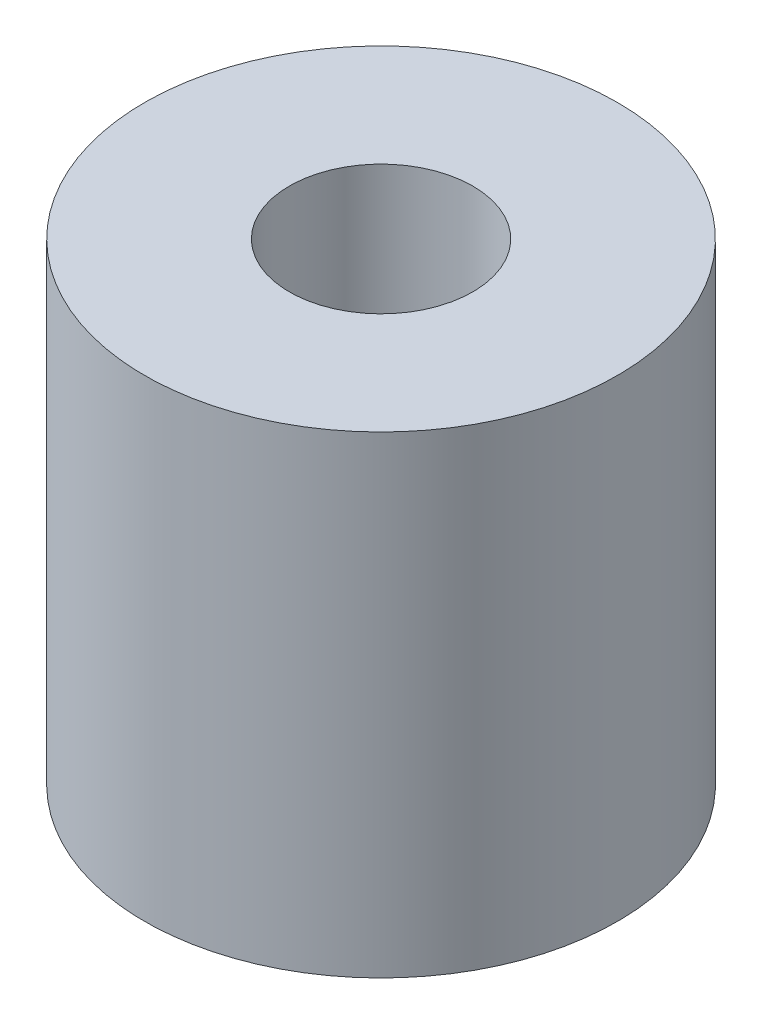
ISO-10303-21;
HEADER;
FILE_DESCRIPTION(('STEP AP214'),'2;1');
FILE_NAME('part.step','',(''),(''),'','','');
FILE_SCHEMA(('AUTOMOTIVE_DESIGN { 1 0 10303 214 1 1 1 1 }'));
ENDSEC;
DATA;
#1=APPLICATION_CONTEXT('core data for automotive mechanical design processes');
#2=APPLICATION_PROTOCOL_DEFINITION('international standard','automotive_design',2000,#1);
#3=PRODUCT_CONTEXT('',#1,'mechanical');
#4=PRODUCT('Part','Part','',(#3));
#5=PRODUCT_RELATED_PRODUCT_CATEGORY('part','',(#4));
#6=PRODUCT_DEFINITION_FORMATION('','',#4);
#7=PRODUCT_DEFINITION_CONTEXT('part definition',#1,'design');
#8=PRODUCT_DEFINITION('design','',#6,#7);
#9=PRODUCT_DEFINITION_SHAPE('','',#8);
#10=(LENGTH_UNIT() NAMED_UNIT(*) SI_UNIT(.MILLI.,.METRE.));
#11=(NAMED_UNIT(*) PLANE_ANGLE_UNIT() SI_UNIT($,.RADIAN.));
#12=(NAMED_UNIT(*) SI_UNIT($,.STERADIAN.) SOLID_ANGLE_UNIT());
#13=UNCERTAINTY_MEASURE_WITH_UNIT(LENGTH_MEASURE(1.E-05),#10,'distance_accuracy_value','');
#14=(GEOMETRIC_REPRESENTATION_CONTEXT(3) GLOBAL_UNCERTAINTY_ASSIGNED_CONTEXT((#13)) GLOBAL_UNIT_ASSIGNED_CONTEXT((#10,
#11,#12)) REPRESENTATION_CONTEXT('',''));
#15=CARTESIAN_POINT('',(0.,0.,0.));
#16=DIRECTION('',(0.,0.,1.));
#17=DIRECTION('',(1.,0.,0.));
#18=AXIS2_PLACEMENT_3D('',#15,#16,#17);
#19=CARTESIAN_POINT('',(0.,6.35,0.));
#20=DIRECTION('',(0.,-1.,0.));
#21=DIRECTION('',(0.,0.,-1.));
#22=AXIS2_PLACEMENT_3D('',#19,#20,#21);
#23=CYLINDRICAL_SURFACE('',#22,2.4638);
#24=CARTESIAN_POINT('',(0.,-6.35,0.));
#25=DIRECTION('',(0.,-1.,0.));
#26=DIRECTION('',(0.,0.,-1.));
#27=AXIS2_PLACEMENT_3D('',#24,#25,#26);
#28=CIRCLE('',#27,2.4638);
#29=CARTESIAN_POINT('',(0.,-6.35,-2.4638));
#30=VERTEX_POINT('',#29);
#31=EDGE_CURVE('E26',#30,#30,#28,.T.);
#32=ORIENTED_EDGE('',*,*,#31,.T.);
#33=EDGE_LOOP('',(#32));
#34=FACE_BOUND('',#33,.T.);
#35=CARTESIAN_POINT('',(0.,6.35,0.));
#36=DIRECTION('',(0.,-1.,0.));
#37=DIRECTION('',(0.,0.,-1.));
#38=AXIS2_PLACEMENT_3D('',#35,#36,#37);
#39=CIRCLE('',#38,2.4638);
#40=CARTESIAN_POINT('',(0.,6.35,-2.4638));
#41=VERTEX_POINT('',#40);
#42=EDGE_CURVE('E17',#41,#41,#39,.T.);
#43=ORIENTED_EDGE('',*,*,#42,.F.);
#44=EDGE_LOOP('',(#43));
#45=FACE_BOUND('',#44,.T.);
#46=ADVANCED_FACE('F14',(#34,#45),#23,.F.);
#47=CARTESIAN_POINT('',(0.,6.35,0.));
#48=DIRECTION('',(0.,1.,0.));
#49=DIRECTION('',(0.,0.,1.));
#50=AXIS2_PLACEMENT_3D('',#47,#48,#49);
#51=PLANE('',#50);
#52=ORIENTED_EDGE('',*,*,#42,.T.);
#53=EDGE_LOOP('',(#52));
#54=FACE_BOUND('',#53,.T.);
#55=CARTESIAN_POINT('',(0.,6.35,0.));
#56=DIRECTION('',(0.,-1.,0.));
#57=DIRECTION('',(0.,0.,-1.));
#58=AXIS2_PLACEMENT_3D('',#55,#56,#57);
#59=CIRCLE('',#58,6.35);
#60=CARTESIAN_POINT('',(0.,6.35,-6.35));
#61=VERTEX_POINT('',#60);
#62=EDGE_CURVE('E21',#61,#61,#59,.T.);
#63=ORIENTED_EDGE('',*,*,#62,.F.);
#64=EDGE_LOOP('',(#63));
#65=FACE_BOUND('',#64,.T.);
#66=ADVANCED_FACE('F34',(#54,#65),#51,.T.);
#67=CARTESIAN_POINT('',(0.,-6.35,0.));
#68=DIRECTION('',(0.,1.,0.));
#69=DIRECTION('',(0.,0.,1.));
#70=AXIS2_PLACEMENT_3D('',#67,#68,#69);
#71=PLANE('',#70);
#72=ORIENTED_EDGE('',*,*,#31,.F.);
#73=EDGE_LOOP('',(#72));
#74=FACE_BOUND('',#73,.T.);
#75=CARTESIAN_POINT('',(0.,-6.35,0.));
#76=DIRECTION('',(0.,-1.,0.));
#77=DIRECTION('',(0.,0.,-1.));
#78=AXIS2_PLACEMENT_3D('',#75,#76,#77);
#79=CIRCLE('',#78,6.35);
#80=CARTESIAN_POINT('',(0.,-6.35,-6.35));
#81=VERTEX_POINT('',#80);
#82=EDGE_CURVE('E9',#81,#81,#79,.F.);
#83=ORIENTED_EDGE('',*,*,#82,.F.);
#84=EDGE_LOOP('',(#83));
#85=FACE_BOUND('',#84,.T.);
#86=ADVANCED_FACE('F42',(#74,#85),#71,.F.);
#87=CARTESIAN_POINT('',(0.,6.35,0.));
#88=DIRECTION('',(0.,-1.,0.));
#89=DIRECTION('',(0.,0.,-1.));
#90=AXIS2_PLACEMENT_3D('',#87,#88,#89);
#91=CYLINDRICAL_SURFACE('',#90,6.35);
#92=ORIENTED_EDGE('',*,*,#62,.T.);
#93=EDGE_LOOP('',(#92));
#94=FACE_BOUND('',#93,.T.);
#95=ORIENTED_EDGE('',*,*,#82,.T.);
#96=EDGE_LOOP('',(#95));
#97=FACE_BOUND('',#96,.T.);
#98=ADVANCED_FACE('F43',(#94,#97),#91,.T.);
#99=CLOSED_SHELL('',(#46,#66,#86,#98));
#100=MANIFOLD_SOLID_BREP('B1',#99);
#101=ADVANCED_BREP_SHAPE_REPRESENTATION('',(#18,#100),#14);
#102=SHAPE_DEFINITION_REPRESENTATION(#9,#101);
ENDSEC;
END-ISO-10303-21;
